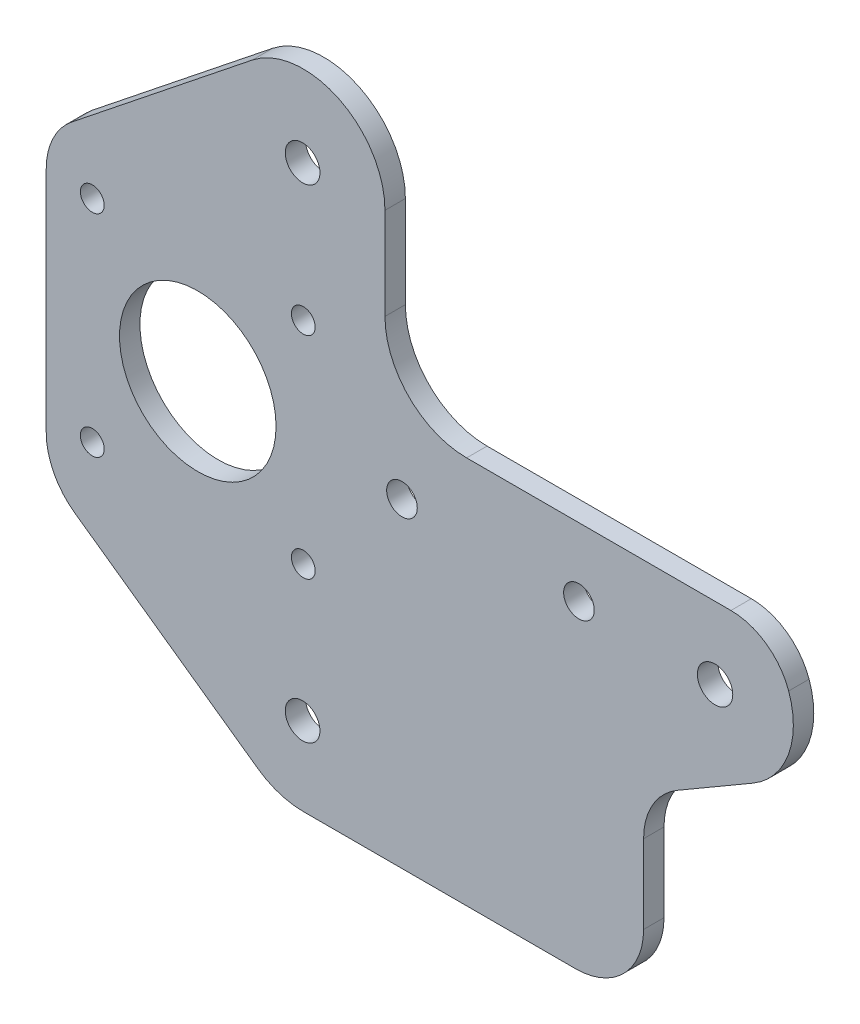
ISO-10303-21;
HEADER;
FILE_DESCRIPTION(('STEP AP214'),'2;1');
FILE_NAME('part.step','',(''),(''),'','','');
FILE_SCHEMA(('AUTOMOTIVE_DESIGN { 1 0 10303 214 1 1 1 1 }'));
ENDSEC;
DATA;
#1=APPLICATION_CONTEXT('core data for automotive mechanical design processes');
#2=APPLICATION_PROTOCOL_DEFINITION('international standard','automotive_design',2000,#1);
#3=PRODUCT_CONTEXT('',#1,'mechanical');
#4=PRODUCT('Part','Part','',(#3));
#5=PRODUCT_RELATED_PRODUCT_CATEGORY('part','',(#4));
#6=PRODUCT_DEFINITION_FORMATION('','',#4);
#7=PRODUCT_DEFINITION_CONTEXT('part definition',#1,'design');
#8=PRODUCT_DEFINITION('design','',#6,#7);
#9=PRODUCT_DEFINITION_SHAPE('','',#8);
#10=(LENGTH_UNIT() NAMED_UNIT(*) SI_UNIT(.MILLI.,.METRE.));
#11=(NAMED_UNIT(*) PLANE_ANGLE_UNIT() SI_UNIT($,.RADIAN.));
#12=(NAMED_UNIT(*) SI_UNIT($,.STERADIAN.) SOLID_ANGLE_UNIT());
#13=UNCERTAINTY_MEASURE_WITH_UNIT(LENGTH_MEASURE(1.E-05),#10,'distance_accuracy_value','');
#14=(GEOMETRIC_REPRESENTATION_CONTEXT(3) GLOBAL_UNCERTAINTY_ASSIGNED_CONTEXT((#13)) GLOBAL_UNIT_ASSIGNED_CONTEXT((#10,
#11,#12)) REPRESENTATION_CONTEXT('',''));
#15=CARTESIAN_POINT('',(0.,0.,0.));
#16=DIRECTION('',(0.,0.,1.));
#17=DIRECTION('',(1.,0.,0.));
#18=AXIS2_PLACEMENT_3D('',#15,#16,#17);
#19=CARTESIAN_POINT('',(0.,0.,0.));
#20=DIRECTION('',(0.,0.,1.));
#21=DIRECTION('',(1.,0.,0.));
#22=AXIS2_PLACEMENT_3D('',#19,#20,#21);
#23=PLANE('',#22);
#24=CARTESIAN_POINT('',(30.,0.,0.));
#25=DIRECTION('',(0.,0.,1.));
#26=DIRECTION('',(1.,0.,0.));
#27=AXIS2_PLACEMENT_3D('',#24,#25,#26);
#28=CIRCLE('',#27,2.25);
#29=CARTESIAN_POINT('',(32.25,0.,0.));
#30=VERTEX_POINT('',#29);
#31=EDGE_CURVE('E151',#30,#30,#28,.T.);
#32=ORIENTED_EDGE('',*,*,#31,.T.);
#33=EDGE_LOOP('',(#32));
#34=FACE_BOUND('',#33,.T.);
#35=CARTESIAN_POINT('',(15.4,-35.5,0.));
#36=DIRECTION('',(0.,0.,1.));
#37=DIRECTION('',(1.,0.,0.));
#38=AXIS2_PLACEMENT_3D('',#35,#36,#37);
#39=CIRCLE('',#38,2.55);
#40=CARTESIAN_POINT('',(17.95,-35.5,0.));
#41=VERTEX_POINT('',#40);
#42=EDGE_CURVE('E279',#41,#41,#39,.T.);
#43=ORIENTED_EDGE('',*,*,#42,.T.);
#44=EDGE_LOOP('',(#43));
#45=FACE_BOUND('',#44,.T.);
#46=CARTESIAN_POINT('',(15.4,35.5,0.));
#47=DIRECTION('',(0.,0.,1.));
#48=DIRECTION('',(1.,0.,0.));
#49=AXIS2_PLACEMENT_3D('',#46,#47,#48);
#50=CIRCLE('',#49,2.55);
#51=CARTESIAN_POINT('',(17.95,35.5,0.));
#52=VERTEX_POINT('',#51);
#53=EDGE_CURVE('E258',#52,#52,#50,.T.);
#54=ORIENTED_EDGE('',*,*,#53,.T.);
#55=EDGE_LOOP('',(#54));
#56=FACE_BOUND('',#55,.T.);
#57=CARTESIAN_POINT('',(-15.5,15.5,0.));
#58=DIRECTION('',(0.,0.,1.));
#59=DIRECTION('',(1.,0.,0.));
#60=AXIS2_PLACEMENT_3D('',#57,#58,#59);
#61=CIRCLE('',#60,1.75);
#62=CARTESIAN_POINT('',(-13.75,15.5,0.));
#63=VERTEX_POINT('',#62);
#64=EDGE_CURVE('E282',#63,#63,#61,.T.);
#65=ORIENTED_EDGE('',*,*,#64,.T.);
#66=EDGE_LOOP('',(#65));
#67=FACE_BOUND('',#66,.T.);
#68=CARTESIAN_POINT('',(-15.5,-15.5,0.));
#69=DIRECTION('',(0.,0.,1.));
#70=DIRECTION('',(1.,0.,0.));
#71=AXIS2_PLACEMENT_3D('',#68,#69,#70);
#72=CIRCLE('',#71,1.75);
#73=CARTESIAN_POINT('',(-13.75,-15.5,0.));
#74=VERTEX_POINT('',#73);
#75=EDGE_CURVE('E255',#74,#74,#72,.T.);
#76=ORIENTED_EDGE('',*,*,#75,.T.);
#77=EDGE_LOOP('',(#76));
#78=FACE_BOUND('',#77,.T.);
#79=CARTESIAN_POINT('',(15.5,-15.5,0.));
#80=DIRECTION('',(0.,0.,1.));
#81=DIRECTION('',(1.,0.,0.));
#82=AXIS2_PLACEMENT_3D('',#79,#80,#81);
#83=CIRCLE('',#82,1.75);
#84=CARTESIAN_POINT('',(17.25,-15.5,0.));
#85=VERTEX_POINT('',#84);
#86=EDGE_CURVE('E285',#85,#85,#83,.T.);
#87=ORIENTED_EDGE('',*,*,#86,.T.);
#88=EDGE_LOOP('',(#87));
#89=FACE_BOUND('',#88,.T.);
#90=CARTESIAN_POINT('',(15.5,15.5,0.));
#91=DIRECTION('',(0.,0.,1.));
#92=DIRECTION('',(1.,0.,0.));
#93=AXIS2_PLACEMENT_3D('',#90,#91,#92);
#94=CIRCLE('',#93,1.75);
#95=CARTESIAN_POINT('',(17.25,15.5,0.));
#96=VERTEX_POINT('',#95);
#97=EDGE_CURVE('E252',#96,#96,#94,.T.);
#98=ORIENTED_EDGE('',*,*,#97,.T.);
#99=EDGE_LOOP('',(#98));
#100=FACE_BOUND('',#99,.T.);
#101=CARTESIAN_POINT('',(0.,0.,0.));
#102=DIRECTION('',(0.,0.,1.));
#103=DIRECTION('',(1.,0.,0.));
#104=AXIS2_PLACEMENT_3D('',#101,#102,#103);
#105=CIRCLE('',#104,11.5);
#106=CARTESIAN_POINT('',(11.5,0.,0.));
#107=VERTEX_POINT('',#106);
#108=EDGE_CURVE('E287',#107,#107,#105,.T.);
#109=ORIENTED_EDGE('',*,*,#108,.T.);
#110=EDGE_LOOP('',(#109));
#111=FACE_BOUND('',#110,.T.);
#112=CARTESIAN_POINT('',(56.,0.,0.));
#113=DIRECTION('',(0.,0.,1.));
#114=DIRECTION('',(1.,0.,0.));
#115=AXIS2_PLACEMENT_3D('',#112,#113,#114);
#116=CIRCLE('',#115,2.25);
#117=CARTESIAN_POINT('',(58.25,0.,0.));
#118=VERTEX_POINT('',#117);
#119=EDGE_CURVE('E249',#118,#118,#116,.T.);
#120=ORIENTED_EDGE('',*,*,#119,.T.);
#121=EDGE_LOOP('',(#120));
#122=FACE_BOUND('',#121,.T.);
#123=CARTESIAN_POINT('',(75.5,0.,0.));
#124=DIRECTION('',(0.,0.,1.));
#125=DIRECTION('',(1.,0.,0.));
#126=AXIS2_PLACEMENT_3D('',#123,#124,#125);
#127=CIRCLE('',#126,12.);
#128=CARTESIAN_POINT('',(81.5363224728649,-10.3712492499026,0.));
#129=VERTEX_POINT('',#128);
#130=CARTESIAN_POINT('',(86.8137084989854,4.00000000000889,0.));
#131=VERTEX_POINT('',#130);
#132=EDGE_CURVE('E263',#129,#131,#127,.T.);
#133=ORIENTED_EDGE('',*,*,#132,.F.);
#134=DIRECTION('',(0.864270770825398,0.503026872738299,0.));
#135=VECTOR('',#134,1.);
#136=CARTESIAN_POINT('',(21.28480903649,-45.43911386449,0.));
#137=LINE('',#136,#135);
#138=CARTESIAN_POINT('',(70.4697312726384,-16.8122778618127,0.));
#139=VERTEX_POINT('',#138);
#140=EDGE_CURVE('E165',#139,#129,#137,.T.);
#141=ORIENTED_EDGE('',*,*,#140,.F.);
#142=CARTESIAN_POINT('',(75.5,-25.45498557008,0.));
#143=DIRECTION('',(0.,0.,1.));
#144=DIRECTION('',(1.,0.,0.));
#145=AXIS2_PLACEMENT_3D('',#142,#143,#144);
#146=CIRCLE('',#145,10.);
#147=CARTESIAN_POINT('',(65.5,-25.45498557008,0.));
#148=VERTEX_POINT('',#147);
#149=EDGE_CURVE('E173',#139,#148,#146,.T.);
#150=ORIENTED_EDGE('',*,*,#149,.T.);
#151=DIRECTION('',(0.,1.,0.));
#152=VECTOR('',#151,1.);
#153=CARTESIAN_POINT('',(65.5,-47.,0.));
#154=LINE('',#153,#152);
#155=CARTESIAN_POINT('',(65.5,-37.,0.));
#156=VERTEX_POINT('',#155);
#157=EDGE_CURVE('E170',#156,#148,#154,.T.);
#158=ORIENTED_EDGE('',*,*,#157,.F.);
#159=CARTESIAN_POINT('',(55.5,-37.,0.));
#160=DIRECTION('',(0.,0.,-1.));
#161=DIRECTION('',(-1.,0.,0.));
#162=AXIS2_PLACEMENT_3D('',#159,#160,#161);
#163=CIRCLE('',#162,10.);
#164=CARTESIAN_POINT('',(55.5,-47.,0.));
#165=VERTEX_POINT('',#164);
#166=EDGE_CURVE('E268',#165,#156,#163,.F.);
#167=ORIENTED_EDGE('',*,*,#166,.F.);
#168=DIRECTION('',(1.,0.,0.));
#169=VECTOR('',#168,1.);
#170=CARTESIAN_POINT('',(15.5,-47.,0.));
#171=LINE('',#170,#169);
#172=CARTESIAN_POINT('',(15.5,-47.,0.));
#173=VERTEX_POINT('',#172);
#174=EDGE_CURVE('E175',#173,#165,#171,.T.);
#175=ORIENTED_EDGE('',*,*,#174,.F.);
#176=CARTESIAN_POINT('',(15.5,-35.5,0.));
#177=DIRECTION('',(0.,0.,1.));
#178=DIRECTION('',(1.,0.,0.));
#179=AXIS2_PLACEMENT_3D('',#176,#177,#178);
#180=CIRCLE('',#179,11.5);
#181=CARTESIAN_POINT('',(8.8483318687912,-44.8811145964812,0.));
#182=VERTEX_POINT('',#181);
#183=EDGE_CURVE('E270',#182,#173,#180,.T.);
#184=ORIENTED_EDGE('',*,*,#183,.F.);
#185=DIRECTION('',(0.815749095346485,-0.578405924452189,0.));
#186=VECTOR('',#185,1.);
#187=CARTESIAN_POINT('',(-18.04825369201,-25.81012263995,0.));
#188=LINE('',#187,#186);
#189=CARTESIAN_POINT('',(-18.0482536919971,-25.8101226399591,0.));
#190=VERTEX_POINT('',#189);
#191=EDGE_CURVE('E179',#190,#182,#188,.T.);
#192=ORIENTED_EDGE('',*,*,#191,.F.);
#193=CARTESIAN_POINT('',(-12.26419444749,-17.65263168648,0.));
#194=DIRECTION('',(0.,0.,1.));
#195=DIRECTION('',(1.,0.,0.));
#196=AXIS2_PLACEMENT_3D('',#193,#194,#195);
#197=CIRCLE('',#196,10.);
#198=CARTESIAN_POINT('',(-22.26419444749,-17.65263168648,0.));
#199=VERTEX_POINT('',#198);
#200=EDGE_CURVE('E272',#199,#190,#197,.T.);
#201=ORIENTED_EDGE('',*,*,#200,.F.);
#202=DIRECTION('',(0.,1.,0.));
#203=VECTOR('',#202,1.);
#204=CARTESIAN_POINT('',(-22.26419444749,15.91967145146,0.));
#205=LINE('',#204,#203);
#206=CARTESIAN_POINT('',(-22.26419444749,15.91967145146,0.));
#207=VERTEX_POINT('',#206);
#208=EDGE_CURVE('E183',#207,#199,#205,.F.);
#209=ORIENTED_EDGE('',*,*,#208,.F.);
#210=CARTESIAN_POINT('',(-12.26419444749,15.91967145146,0.));
#211=DIRECTION('',(0.,0.,1.));
#212=DIRECTION('',(1.,0.,0.));
#213=AXIS2_PLACEMENT_3D('',#210,#211,#212);
#214=CIRCLE('',#213,10.);
#215=CARTESIAN_POINT('',(-18.4985911058109,23.7383860713092,0.));
#216=VERTEX_POINT('',#215);
#217=EDGE_CURVE('E274',#216,#207,#214,.T.);
#218=ORIENTED_EDGE('',*,*,#217,.F.);
#219=DIRECTION('',(-0.781871461986013,-0.62343966583131,0.));
#220=VECTOR('',#219,1.);
#221=CARTESIAN_POINT('',(8.018724010025,44.88245754383,0.));
#222=LINE('',#221,#220);
#223=CARTESIAN_POINT('',(8.01872401003507,44.882457543838,0.));
#224=VERTEX_POINT('',#223);
#225=EDGE_CURVE('E187',#224,#216,#222,.T.);
#226=ORIENTED_EDGE('',*,*,#225,.F.);
#227=CARTESIAN_POINT('',(15.5,35.5,0.));
#228=DIRECTION('',(0.,0.,1.));
#229=DIRECTION('',(1.,0.,0.));
#230=AXIS2_PLACEMENT_3D('',#227,#228,#229);
#231=CIRCLE('',#230,12.);
#232=CARTESIAN_POINT('',(27.5,35.5,0.));
#233=VERTEX_POINT('',#232);
#234=EDGE_CURVE('E139',#233,#224,#231,.T.);
#235=ORIENTED_EDGE('',*,*,#234,.F.);
#236=DIRECTION('',(0.,1.,0.));
#237=VECTOR('',#236,1.);
#238=CARTESIAN_POINT('',(27.5,35.5,0.));
#239=LINE('',#238,#237);
#240=CARTESIAN_POINT('',(27.5,22.,0.));
#241=VERTEX_POINT('',#240);
#242=EDGE_CURVE('E133',#233,#241,#239,.F.);
#243=ORIENTED_EDGE('',*,*,#242,.T.);
#244=CARTESIAN_POINT('',(39.5,22.,0.));
#245=DIRECTION('',(0.,0.,1.));
#246=DIRECTION('',(1.,0.,0.));
#247=AXIS2_PLACEMENT_3D('',#244,#245,#246);
#248=CIRCLE('',#247,12.);
#249=CARTESIAN_POINT('',(39.5,10.,0.));
#250=VERTEX_POINT('',#249);
#251=EDGE_CURVE('E136',#241,#250,#248,.T.);
#252=ORIENTED_EDGE('',*,*,#251,.T.);
#253=DIRECTION('',(1.,0.,0.));
#254=VECTOR('',#253,1.);
#255=CARTESIAN_POINT('',(39.5,10.,0.));
#256=LINE('',#255,#254);
#257=CARTESIAN_POINT('',(78.32842712475,10.,0.));
#258=VERTEX_POINT('',#257);
#259=EDGE_CURVE('E162',#250,#258,#256,.T.);
#260=ORIENTED_EDGE('',*,*,#259,.T.);
#261=CARTESIAN_POINT('',(78.32842712475,1.,0.));
#262=DIRECTION('',(0.,0.,1.));
#263=DIRECTION('',(1.,0.,0.));
#264=AXIS2_PLACEMENT_3D('',#261,#262,#263);
#265=CIRCLE('',#264,9.00000000000001);
#266=EDGE_CURVE('E261',#131,#258,#265,.T.);
#267=ORIENTED_EDGE('',*,*,#266,.F.);
#268=EDGE_LOOP('',(#133,#141,#150,#158,#167,#175,#184,#192,#201,#209,#218,#226,#235,#243,#252,
#260,#267));
#269=FACE_BOUND('',#268,.T.);
#270=CARTESIAN_POINT('',(76.,-0.574456264653834,0.));
#271=DIRECTION('',(0.,0.,1.));
#272=DIRECTION('',(1.,0.,0.));
#273=AXIS2_PLACEMENT_3D('',#270,#271,#272);
#274=CIRCLE('',#273,2.6);
#275=CARTESIAN_POINT('',(78.6,-0.574456264653834,0.));
#276=VERTEX_POINT('',#275);
#277=EDGE_CURVE('E19',#276,#276,#274,.T.);
#278=ORIENTED_EDGE('',*,*,#277,.T.);
#279=EDGE_LOOP('',(#278));
#280=FACE_BOUND('',#279,.T.);
#281=ADVANCED_FACE('F16',(#34,#45,#56,#67,#78,#89,#100,#111,#122,#269,#280),#23,.F.);
#282=CARTESIAN_POINT('',(76.,-0.574456264653834,3.));
#283=DIRECTION('',(0.,0.,1.));
#284=DIRECTION('',(1.,0.,0.));
#285=AXIS2_PLACEMENT_3D('',#282,#283,#284);
#286=CYLINDRICAL_SURFACE('',#285,2.6);
#287=CARTESIAN_POINT('',(76.,-0.574456264653834,3.));
#288=DIRECTION('',(0.,0.,1.));
#289=DIRECTION('',(1.,0.,0.));
#290=AXIS2_PLACEMENT_3D('',#287,#288,#289);
#291=CIRCLE('',#290,2.6);
#292=CARTESIAN_POINT('',(78.6,-0.574456264653834,3.));
#293=VERTEX_POINT('',#292);
#294=EDGE_CURVE('E246',#293,#293,#291,.F.);
#295=ORIENTED_EDGE('',*,*,#294,.F.);
#296=EDGE_LOOP('',(#295));
#297=FACE_BOUND('',#296,.T.);
#298=ORIENTED_EDGE('',*,*,#277,.F.);
#299=EDGE_LOOP('',(#298));
#300=FACE_BOUND('',#299,.T.);
#301=ADVANCED_FACE('F294',(#297,#300),#286,.F.);
#302=CARTESIAN_POINT('',(0.,0.,0.));
#303=DIRECTION('',(0.,0.,1.));
#304=DIRECTION('',(1.,0.,0.));
#305=AXIS2_PLACEMENT_3D('',#302,#303,#304);
#306=CYLINDRICAL_SURFACE('',#305,11.5);
#307=CARTESIAN_POINT('',(0.,0.,3.));
#308=DIRECTION('',(0.,0.,1.));
#309=DIRECTION('',(1.,0.,0.));
#310=AXIS2_PLACEMENT_3D('',#307,#308,#309);
#311=CIRCLE('',#310,11.5);
#312=CARTESIAN_POINT('',(11.5,0.,3.));
#313=VERTEX_POINT('',#312);
#314=EDGE_CURVE('E243',#313,#313,#311,.F.);
#315=ORIENTED_EDGE('',*,*,#314,.F.);
#316=EDGE_LOOP('',(#315));
#317=FACE_BOUND('',#316,.T.);
#318=ORIENTED_EDGE('',*,*,#108,.F.);
#319=EDGE_LOOP('',(#318));
#320=FACE_BOUND('',#319,.T.);
#321=ADVANCED_FACE('F296',(#317,#320),#306,.F.);
#322=CARTESIAN_POINT('',(15.5,-15.5,0.));
#323=DIRECTION('',(0.,0.,1.));
#324=DIRECTION('',(1.,0.,0.));
#325=AXIS2_PLACEMENT_3D('',#322,#323,#324);
#326=CYLINDRICAL_SURFACE('',#325,1.75);
#327=CARTESIAN_POINT('',(15.5,-15.5,3.));
#328=DIRECTION('',(0.,0.,1.));
#329=DIRECTION('',(1.,0.,0.));
#330=AXIS2_PLACEMENT_3D('',#327,#328,#329);
#331=CIRCLE('',#330,1.75);
#332=CARTESIAN_POINT('',(17.25,-15.5,3.));
#333=VERTEX_POINT('',#332);
#334=EDGE_CURVE('E240',#333,#333,#331,.F.);
#335=ORIENTED_EDGE('',*,*,#334,.F.);
#336=EDGE_LOOP('',(#335));
#337=FACE_BOUND('',#336,.T.);
#338=ORIENTED_EDGE('',*,*,#86,.F.);
#339=EDGE_LOOP('',(#338));
#340=FACE_BOUND('',#339,.T.);
#341=ADVANCED_FACE('F303',(#337,#340),#326,.F.);
#342=CARTESIAN_POINT('',(-15.5,15.5,0.));
#343=DIRECTION('',(0.,0.,1.));
#344=DIRECTION('',(1.,0.,0.));
#345=AXIS2_PLACEMENT_3D('',#342,#343,#344);
#346=CYLINDRICAL_SURFACE('',#345,1.75);
#347=CARTESIAN_POINT('',(-15.5,15.5,3.));
#348=DIRECTION('',(0.,0.,1.));
#349=DIRECTION('',(1.,0.,0.));
#350=AXIS2_PLACEMENT_3D('',#347,#348,#349);
#351=CIRCLE('',#350,1.75);
#352=CARTESIAN_POINT('',(-13.75,15.5,3.));
#353=VERTEX_POINT('',#352);
#354=EDGE_CURVE('E237',#353,#353,#351,.F.);
#355=ORIENTED_EDGE('',*,*,#354,.F.);
#356=EDGE_LOOP('',(#355));
#357=FACE_BOUND('',#356,.T.);
#358=ORIENTED_EDGE('',*,*,#64,.F.);
#359=EDGE_LOOP('',(#358));
#360=FACE_BOUND('',#359,.T.);
#361=ADVANCED_FACE('F402',(#357,#360),#346,.F.);
#362=CARTESIAN_POINT('',(15.4,-35.5,0.));
#363=DIRECTION('',(0.,0.,1.));
#364=DIRECTION('',(1.,0.,0.));
#365=AXIS2_PLACEMENT_3D('',#362,#363,#364);
#366=CYLINDRICAL_SURFACE('',#365,2.55);
#367=CARTESIAN_POINT('',(15.4,-35.5,3.));
#368=DIRECTION('',(0.,0.,1.));
#369=DIRECTION('',(1.,0.,0.));
#370=AXIS2_PLACEMENT_3D('',#367,#368,#369);
#371=CIRCLE('',#370,2.55);
#372=CARTESIAN_POINT('',(17.95,-35.5,3.));
#373=VERTEX_POINT('',#372);
#374=EDGE_CURVE('E234',#373,#373,#371,.F.);
#375=ORIENTED_EDGE('',*,*,#374,.F.);
#376=EDGE_LOOP('',(#375));
#377=FACE_BOUND('',#376,.T.);
#378=ORIENTED_EDGE('',*,*,#42,.F.);
#379=EDGE_LOOP('',(#378));
#380=FACE_BOUND('',#379,.T.);
#381=ADVANCED_FACE('F398',(#377,#380),#366,.F.);
#382=CARTESIAN_POINT('',(30.,0.,3.));
#383=DIRECTION('',(0.,0.,1.));
#384=DIRECTION('',(1.,0.,0.));
#385=AXIS2_PLACEMENT_3D('',#382,#383,#384);
#386=CYLINDRICAL_SURFACE('',#385,2.25);
#387=CARTESIAN_POINT('',(30.,0.,3.));
#388=DIRECTION('',(0.,0.,1.));
#389=DIRECTION('',(1.,0.,0.));
#390=AXIS2_PLACEMENT_3D('',#387,#388,#389);
#391=CIRCLE('',#390,2.25);
#392=CARTESIAN_POINT('',(32.25,0.,3.));
#393=VERTEX_POINT('',#392);
#394=EDGE_CURVE('E231',#393,#393,#391,.F.);
#395=ORIENTED_EDGE('',*,*,#394,.F.);
#396=EDGE_LOOP('',(#395));
#397=FACE_BOUND('',#396,.T.);
#398=ORIENTED_EDGE('',*,*,#31,.F.);
#399=EDGE_LOOP('',(#398));
#400=FACE_BOUND('',#399,.T.);
#401=ADVANCED_FACE('F395',(#397,#400),#386,.F.);
#402=CARTESIAN_POINT('',(39.5,22.,3.));
#403=DIRECTION('',(0.,0.,1.));
#404=DIRECTION('',(1.,0.,0.));
#405=AXIS2_PLACEMENT_3D('',#402,#403,#404);
#406=CYLINDRICAL_SURFACE('',#405,12.);
#407=CARTESIAN_POINT('',(39.5,22.,3.));
#408=DIRECTION('',(0.,0.,1.));
#409=DIRECTION('',(1.,0.,0.));
#410=AXIS2_PLACEMENT_3D('',#407,#408,#409);
#411=CIRCLE('',#410,12.);
#412=CARTESIAN_POINT('',(39.5,9.99999999999987,3.));
#413=VERTEX_POINT('',#412);
#414=CARTESIAN_POINT('',(27.5,22.,3.));
#415=VERTEX_POINT('',#414);
#416=EDGE_CURVE('E229',#413,#415,#411,.F.);
#417=ORIENTED_EDGE('',*,*,#416,.F.);
#418=DIRECTION('',(0.,0.,-1.));
#419=VECTOR('',#418,1.);
#420=CARTESIAN_POINT('',(39.5,10.,3.));
#421=LINE('',#420,#419);
#422=EDGE_CURVE('E149',#413,#250,#421,.T.);
#423=ORIENTED_EDGE('',*,*,#422,.T.);
#424=ORIENTED_EDGE('',*,*,#251,.F.);
#425=DIRECTION('',(0.,0.,1.));
#426=VECTOR('',#425,1.);
#427=CARTESIAN_POINT('',(27.5,22.,3.));
#428=LINE('',#427,#426);
#429=EDGE_CURVE('E143',#241,#415,#428,.T.);
#430=ORIENTED_EDGE('',*,*,#429,.T.);
#431=EDGE_LOOP('',(#417,#423,#424,#430));
#432=FACE_BOUND('',#431,.T.);
#433=ADVANCED_FACE('F146',(#432),#406,.F.);
#434=CARTESIAN_POINT('',(27.5,35.5,3.));
#435=DIRECTION('',(-1.,0.,0.));
#436=DIRECTION('',(0.,0.,1.));
#437=AXIS2_PLACEMENT_3D('',#434,#435,#436);
#438=PLANE('',#437);
#439=DIRECTION('',(0.,1.,0.));
#440=VECTOR('',#439,1.);
#441=CARTESIAN_POINT('',(27.5,22.,3.));
#442=LINE('',#441,#440);
#443=CARTESIAN_POINT('',(27.5,35.5,3.));
#444=VERTEX_POINT('',#443);
#445=EDGE_CURVE('E155',#415,#444,#442,.T.);
#446=ORIENTED_EDGE('',*,*,#445,.F.);
#447=ORIENTED_EDGE('',*,*,#429,.F.);
#448=ORIENTED_EDGE('',*,*,#242,.F.);
#449=DIRECTION('',(0.,0.,1.));
#450=VECTOR('',#449,1.);
#451=CARTESIAN_POINT('',(27.5,35.5,0.));
#452=LINE('',#451,#450);
#453=EDGE_CURVE('E157',#444,#233,#452,.F.);
#454=ORIENTED_EDGE('',*,*,#453,.F.);
#455=EDGE_LOOP('',(#446,#447,#448,#454));
#456=FACE_BOUND('',#455,.T.);
#457=ADVANCED_FACE('F153',(#456),#438,.F.);
#458=CARTESIAN_POINT('',(15.5,35.5,0.));
#459=DIRECTION('',(0.,0.,1.));
#460=DIRECTION('',(1.,0.,0.));
#461=AXIS2_PLACEMENT_3D('',#458,#459,#460);
#462=CYLINDRICAL_SURFACE('',#461,12.);
#463=ORIENTED_EDGE('',*,*,#453,.T.);
#464=ORIENTED_EDGE('',*,*,#234,.T.);
#465=DIRECTION('',(0.,0.,1.));
#466=VECTOR('',#465,1.);
#467=CARTESIAN_POINT('',(8.01872401004453,44.8824575438456,0.));
#468=LINE('',#467,#466);
#469=CARTESIAN_POINT('',(8.01872401003358,44.8824575438399,3.));
#470=VERTEX_POINT('',#469);
#471=EDGE_CURVE('E189',#470,#224,#468,.F.);
#472=ORIENTED_EDGE('',*,*,#471,.F.);
#473=CARTESIAN_POINT('',(15.5,35.5,3.));
#474=DIRECTION('',(0.,0.,1.));
#475=DIRECTION('',(1.,0.,0.));
#476=AXIS2_PLACEMENT_3D('',#473,#474,#475);
#477=CIRCLE('',#476,12.);
#478=EDGE_CURVE('E226',#444,#470,#477,.T.);
#479=ORIENTED_EDGE('',*,*,#478,.F.);
#480=EDGE_LOOP('',(#463,#464,#472,#479));
#481=FACE_BOUND('',#480,.T.);
#482=ADVANCED_FACE('F386',(#481),#462,.T.);
#483=CARTESIAN_POINT('',(8.018724010025,44.88245754383,0.));
#484=DIRECTION('',(-0.62343966583131,0.781871461986013,0.));
#485=DIRECTION('',(-0.781871461986013,-0.62343966583131,0.));
#486=AXIS2_PLACEMENT_3D('',#483,#484,#485);
#487=PLANE('',#486);
#488=ORIENTED_EDGE('',*,*,#471,.T.);
#489=ORIENTED_EDGE('',*,*,#225,.T.);
#490=DIRECTION('',(0.,0.,1.));
#491=VECTOR('',#490,1.);
#492=CARTESIAN_POINT('',(-18.4985911058232,23.7383860713041,0.));
#493=LINE('',#492,#491);
#494=CARTESIAN_POINT('',(-18.4985911058124,23.7383860713111,3.));
#495=VERTEX_POINT('',#494);
#496=EDGE_CURVE('E188',#495,#216,#493,.F.);
#497=ORIENTED_EDGE('',*,*,#496,.F.);
#498=DIRECTION('',(-0.781871461986012,-0.62343966583131,0.));
#499=VECTOR('',#498,1.);
#500=CARTESIAN_POINT('',(8.01872401004155,44.8824575438493,3.));
#501=LINE('',#500,#499);
#502=EDGE_CURVE('E225',#470,#495,#501,.T.);
#503=ORIENTED_EDGE('',*,*,#502,.F.);
#504=EDGE_LOOP('',(#488,#489,#497,#503));
#505=FACE_BOUND('',#504,.T.);
#506=ADVANCED_FACE('F382',(#505),#487,.T.);
#507=CARTESIAN_POINT('',(-12.26419444749,15.91967145146,0.));
#508=DIRECTION('',(0.,0.,1.));
#509=DIRECTION('',(1.,0.,0.));
#510=AXIS2_PLACEMENT_3D('',#507,#508,#509);
#511=CYLINDRICAL_SURFACE('',#510,10.);
#512=ORIENTED_EDGE('',*,*,#496,.T.);
#513=ORIENTED_EDGE('',*,*,#217,.T.);
#514=DIRECTION('',(0.,0.,1.));
#515=VECTOR('',#514,1.);
#516=CARTESIAN_POINT('',(-22.26419444749,15.91967145146,0.));
#517=LINE('',#516,#515);
#518=CARTESIAN_POINT('',(-22.2641944474894,15.91967145146,3.));
#519=VERTEX_POINT('',#518);
#520=EDGE_CURVE('E186',#519,#207,#517,.F.);
#521=ORIENTED_EDGE('',*,*,#520,.F.);
#522=CARTESIAN_POINT('',(-12.26419444749,15.91967145146,3.));
#523=DIRECTION('',(0.,0.,1.));
#524=DIRECTION('',(1.,0.,0.));
#525=AXIS2_PLACEMENT_3D('',#522,#523,#524);
#526=CIRCLE('',#525,10.);
#527=EDGE_CURVE('E222',#495,#519,#526,.T.);
#528=ORIENTED_EDGE('',*,*,#527,.F.);
#529=EDGE_LOOP('',(#512,#513,#521,#528));
#530=FACE_BOUND('',#529,.T.);
#531=ADVANCED_FACE('F378',(#530),#511,.T.);
#532=CARTESIAN_POINT('',(-22.26419444749,15.91967145146,0.));
#533=DIRECTION('',(-1.,0.,0.));
#534=DIRECTION('',(0.,0.,1.));
#535=AXIS2_PLACEMENT_3D('',#532,#533,#534);
#536=PLANE('',#535);
#537=ORIENTED_EDGE('',*,*,#520,.T.);
#538=ORIENTED_EDGE('',*,*,#208,.T.);
#539=DIRECTION('',(0.,0.,1.));
#540=VECTOR('',#539,1.);
#541=CARTESIAN_POINT('',(-22.26419444749,-17.65263168648,0.));
#542=LINE('',#541,#540);
#543=CARTESIAN_POINT('',(-22.2641944474894,-17.65263168648,3.));
#544=VERTEX_POINT('',#543);
#545=EDGE_CURVE('E185',#544,#199,#542,.F.);
#546=ORIENTED_EDGE('',*,*,#545,.F.);
#547=DIRECTION('',(0.,1.,0.));
#548=VECTOR('',#547,1.);
#549=CARTESIAN_POINT('',(-22.2641944474887,22.,3.));
#550=LINE('',#549,#548);
#551=EDGE_CURVE('E221',#519,#544,#550,.F.);
#552=ORIENTED_EDGE('',*,*,#551,.F.);
#553=EDGE_LOOP('',(#537,#538,#546,#552));
#554=FACE_BOUND('',#553,.T.);
#555=ADVANCED_FACE('F374',(#554),#536,.T.);
#556=CARTESIAN_POINT('',(-12.26419444749,-17.65263168648,0.));
#557=DIRECTION('',(0.,0.,1.));
#558=DIRECTION('',(1.,0.,0.));
#559=AXIS2_PLACEMENT_3D('',#556,#557,#558);
#560=CYLINDRICAL_SURFACE('',#559,10.);
#561=ORIENTED_EDGE('',*,*,#545,.T.);
#562=ORIENTED_EDGE('',*,*,#200,.T.);
#563=DIRECTION('',(0.,0.,1.));
#564=VECTOR('',#563,1.);
#565=CARTESIAN_POINT('',(-18.0482536919806,-25.8101226399708,0.));
#566=LINE('',#565,#564);
#567=CARTESIAN_POINT('',(-18.0482536919968,-25.8101226399584,3.));
#568=VERTEX_POINT('',#567);
#569=EDGE_CURVE('E182',#568,#190,#566,.F.);
#570=ORIENTED_EDGE('',*,*,#569,.F.);
#571=CARTESIAN_POINT('',(-12.26419444749,-17.65263168648,3.));
#572=DIRECTION('',(0.,0.,1.));
#573=DIRECTION('',(1.,0.,0.));
#574=AXIS2_PLACEMENT_3D('',#571,#572,#573);
#575=CIRCLE('',#574,10.);
#576=EDGE_CURVE('E218',#544,#568,#575,.T.);
#577=ORIENTED_EDGE('',*,*,#576,.F.);
#578=EDGE_LOOP('',(#561,#562,#570,#577));
#579=FACE_BOUND('',#578,.T.);
#580=ADVANCED_FACE('F370',(#579),#560,.T.);
#581=CARTESIAN_POINT('',(-18.04825369201,-25.81012263995,0.));
#582=DIRECTION('',(-0.578405924452189,-0.815749095346485,0.));
#583=DIRECTION('',(0.815749095346485,-0.578405924452189,0.));
#584=AXIS2_PLACEMENT_3D('',#581,#582,#583);
#585=PLANE('',#584);
#586=ORIENTED_EDGE('',*,*,#569,.T.);
#587=ORIENTED_EDGE('',*,*,#191,.T.);
#588=DIRECTION('',(0.,0.,1.));
#589=VECTOR('',#588,1.);
#590=CARTESIAN_POINT('',(8.84833186878513,-44.8811145964742,0.));
#591=LINE('',#590,#589);
#592=CARTESIAN_POINT('',(8.84833186879134,-44.8811145964808,3.));
#593=VERTEX_POINT('',#592);
#594=EDGE_CURVE('E181',#593,#182,#591,.F.);
#595=ORIENTED_EDGE('',*,*,#594,.F.);
#596=DIRECTION('',(0.815749095346473,-0.578405924452207,0.));
#597=VECTOR('',#596,1.);
#598=CARTESIAN_POINT('',(-18.0482536919797,-25.8101226399696,3.));
#599=LINE('',#598,#597);
#600=EDGE_CURVE('E217',#568,#593,#599,.T.);
#601=ORIENTED_EDGE('',*,*,#600,.F.);
#602=EDGE_LOOP('',(#586,#587,#595,#601));
#603=FACE_BOUND('',#602,.T.);
#604=ADVANCED_FACE('F366',(#603),#585,.T.);
#605=CARTESIAN_POINT('',(15.5,-35.5,0.));
#606=DIRECTION('',(0.,0.,1.));
#607=DIRECTION('',(1.,0.,0.));
#608=AXIS2_PLACEMENT_3D('',#605,#606,#607);
#609=CYLINDRICAL_SURFACE('',#608,11.5);
#610=DIRECTION('',(0.,0.,-1.));
#611=VECTOR('',#610,1.);
#612=CARTESIAN_POINT('',(15.5,-47.,3.));
#613=LINE('',#612,#611);
#614=CARTESIAN_POINT('',(15.5,-47.0000000000009,3.));
#615=VERTEX_POINT('',#614);
#616=EDGE_CURVE('E178',#615,#173,#613,.T.);
#617=ORIENTED_EDGE('',*,*,#616,.F.);
#618=CARTESIAN_POINT('',(15.5,-35.5,3.));
#619=DIRECTION('',(0.,0.,1.));
#620=DIRECTION('',(1.,0.,0.));
#621=AXIS2_PLACEMENT_3D('',#618,#619,#620);
#622=CIRCLE('',#621,11.5);
#623=EDGE_CURVE('E214',#593,#615,#622,.T.);
#624=ORIENTED_EDGE('',*,*,#623,.F.);
#625=ORIENTED_EDGE('',*,*,#594,.T.);
#626=ORIENTED_EDGE('',*,*,#183,.T.);
#627=EDGE_LOOP('',(#617,#624,#625,#626));
#628=FACE_BOUND('',#627,.T.);
#629=ADVANCED_FACE('F362',(#628),#609,.T.);
#630=CARTESIAN_POINT('',(15.5,-47.,3.));
#631=DIRECTION('',(0.,-1.,0.));
#632=DIRECTION('',(0.,0.,-1.));
#633=AXIS2_PLACEMENT_3D('',#630,#631,#632);
#634=PLANE('',#633);
#635=DIRECTION('',(0.,0.,-1.));
#636=VECTOR('',#635,1.);
#637=CARTESIAN_POINT('',(55.5,-47.,15.3276));
#638=LINE('',#637,#636);
#639=CARTESIAN_POINT('',(55.5,-47.0000000000009,3.));
#640=VERTEX_POINT('',#639);
#641=EDGE_CURVE('E177',#640,#165,#638,.T.);
#642=ORIENTED_EDGE('',*,*,#641,.F.);
#643=DIRECTION('',(1.,0.,0.));
#644=VECTOR('',#643,1.);
#645=CARTESIAN_POINT('',(39.5,-47.0000000000018,3.));
#646=LINE('',#645,#644);
#647=EDGE_CURVE('E213',#615,#640,#646,.T.);
#648=ORIENTED_EDGE('',*,*,#647,.F.);
#649=ORIENTED_EDGE('',*,*,#616,.T.);
#650=ORIENTED_EDGE('',*,*,#174,.T.);
#651=EDGE_LOOP('',(#642,#648,#649,#650));
#652=FACE_BOUND('',#651,.T.);
#653=ADVANCED_FACE('F358',(#652),#634,.T.);
#654=CARTESIAN_POINT('',(55.5,-37.,15.3276));
#655=DIRECTION('',(0.,0.,-1.));
#656=DIRECTION('',(-1.,0.,0.));
#657=AXIS2_PLACEMENT_3D('',#654,#655,#656);
#658=CYLINDRICAL_SURFACE('',#657,10.);
#659=ORIENTED_EDGE('',*,*,#641,.T.);
#660=ORIENTED_EDGE('',*,*,#166,.T.);
#661=DIRECTION('',(0.,0.,-1.));
#662=VECTOR('',#661,1.);
#663=CARTESIAN_POINT('',(65.5,-37.,3.));
#664=LINE('',#663,#662);
#665=CARTESIAN_POINT('',(65.5,-37.,3.));
#666=VERTEX_POINT('',#665);
#667=EDGE_CURVE('E174',#666,#156,#664,.T.);
#668=ORIENTED_EDGE('',*,*,#667,.F.);
#669=CARTESIAN_POINT('',(55.5,-37.,3.));
#670=DIRECTION('',(0.,0.,-1.));
#671=DIRECTION('',(-1.,0.,0.));
#672=AXIS2_PLACEMENT_3D('',#669,#670,#671);
#673=CIRCLE('',#672,10.);
#674=EDGE_CURVE('E210',#640,#666,#673,.F.);
#675=ORIENTED_EDGE('',*,*,#674,.F.);
#676=EDGE_LOOP('',(#659,#660,#668,#675));
#677=FACE_BOUND('',#676,.T.);
#678=ADVANCED_FACE('F354',(#677),#658,.T.);
#679=CARTESIAN_POINT('',(65.5,-47.,3.));
#680=DIRECTION('',(1.,0.,0.));
#681=DIRECTION('',(0.,0.,-1.));
#682=AXIS2_PLACEMENT_3D('',#679,#680,#681);
#683=PLANE('',#682);
#684=ORIENTED_EDGE('',*,*,#667,.T.);
#685=ORIENTED_EDGE('',*,*,#157,.T.);
#686=DIRECTION('',(0.,0.,1.));
#687=VECTOR('',#686,1.);
#688=CARTESIAN_POINT('',(65.5,-25.45498557008,-12.3276));
#689=LINE('',#688,#687);
#690=CARTESIAN_POINT('',(65.5,-25.45498557008,3.));
#691=VERTEX_POINT('',#690);
#692=EDGE_CURVE('E267',#148,#691,#689,.T.);
#693=ORIENTED_EDGE('',*,*,#692,.T.);
#694=DIRECTION('',(0.,1.,0.));
#695=VECTOR('',#694,1.);
#696=CARTESIAN_POINT('',(65.5,22.,3.));
#697=LINE('',#696,#695);
#698=EDGE_CURVE('E209',#666,#691,#697,.T.);
#699=ORIENTED_EDGE('',*,*,#698,.F.);
#700=EDGE_LOOP('',(#684,#685,#693,#699));
#701=FACE_BOUND('',#700,.T.);
#702=ADVANCED_FACE('F350',(#701),#683,.T.);
#703=CARTESIAN_POINT('',(75.5,-25.45498557008,-12.3276));
#704=DIRECTION('',(0.,0.,1.));
#705=DIRECTION('',(1.,0.,0.));
#706=AXIS2_PLACEMENT_3D('',#703,#704,#705);
#707=CYLINDRICAL_SURFACE('',#706,10.);
#708=ORIENTED_EDGE('',*,*,#149,.F.);
#709=DIRECTION('',(0.,0.,1.));
#710=VECTOR('',#709,1.);
#711=CARTESIAN_POINT('',(70.4697312726601,-16.8122778618001,0.));
#712=LINE('',#711,#710);
#713=CARTESIAN_POINT('',(70.469731272638,-16.812277861813,3.));
#714=VERTEX_POINT('',#713);
#715=EDGE_CURVE('E169',#714,#139,#712,.F.);
#716=ORIENTED_EDGE('',*,*,#715,.F.);
#717=CARTESIAN_POINT('',(75.5,-25.45498557008,3.));
#718=DIRECTION('',(0.,0.,1.));
#719=DIRECTION('',(1.,0.,0.));
#720=AXIS2_PLACEMENT_3D('',#717,#718,#719);
#721=CIRCLE('',#720,10.);
#722=EDGE_CURVE('E206',#691,#714,#721,.F.);
#723=ORIENTED_EDGE('',*,*,#722,.F.);
#724=ORIENTED_EDGE('',*,*,#692,.F.);
#725=EDGE_LOOP('',(#708,#716,#723,#724));
#726=FACE_BOUND('',#725,.T.);
#727=ADVANCED_FACE('F346',(#726),#707,.F.);
#728=CARTESIAN_POINT('',(21.28480903649,-45.43911386449,0.));
#729=DIRECTION('',(0.503026872738299,-0.864270770825398,0.));
#730=DIRECTION('',(0.864270770825398,0.503026872738299,0.));
#731=AXIS2_PLACEMENT_3D('',#728,#729,#730);
#732=PLANE('',#731);
#733=ORIENTED_EDGE('',*,*,#715,.T.);
#734=ORIENTED_EDGE('',*,*,#140,.T.);
#735=DIRECTION('',(0.,0.,1.));
#736=VECTOR('',#735,1.);
#737=CARTESIAN_POINT('',(81.5363224728694,-10.371249249899,0.));
#738=LINE('',#737,#736);
#739=CARTESIAN_POINT('',(81.5363224728651,-10.3712492499019,3.));
#740=VERTEX_POINT('',#739);
#741=EDGE_CURVE('E168',#740,#129,#738,.F.);
#742=ORIENTED_EDGE('',*,*,#741,.F.);
#743=DIRECTION('',(0.86427077082535,0.503026872738381,0.));
#744=VECTOR('',#743,1.);
#745=CARTESIAN_POINT('',(70.4697312726601,-16.8122778618002,3.));
#746=LINE('',#745,#744);
#747=EDGE_CURVE('E205',#714,#740,#746,.T.);
#748=ORIENTED_EDGE('',*,*,#747,.F.);
#749=EDGE_LOOP('',(#733,#734,#742,#748));
#750=FACE_BOUND('',#749,.T.);
#751=ADVANCED_FACE('F342',(#750),#732,.T.);
#752=CARTESIAN_POINT('',(75.5,0.,0.));
#753=DIRECTION('',(0.,0.,1.));
#754=DIRECTION('',(1.,0.,0.));
#755=AXIS2_PLACEMENT_3D('',#752,#753,#754);
#756=CYLINDRICAL_SURFACE('',#755,12.);
#757=DIRECTION('',(0.,0.,1.));
#758=VECTOR('',#757,1.);
#759=CARTESIAN_POINT('',(86.813708498981,4.00000000002136,-11.1252));
#760=LINE('',#759,#758);
#761=CARTESIAN_POINT('',(86.8137084989854,4.00000000000889,3.));
#762=VERTEX_POINT('',#761);
#763=EDGE_CURVE('E164',#762,#131,#760,.F.);
#764=ORIENTED_EDGE('',*,*,#763,.F.);
#765=CARTESIAN_POINT('',(75.5,0.,3.));
#766=DIRECTION('',(0.,0.,1.));
#767=DIRECTION('',(1.,0.,0.));
#768=AXIS2_PLACEMENT_3D('',#765,#766,#767);
#769=CIRCLE('',#768,12.);
#770=EDGE_CURVE('E203',#740,#762,#769,.T.);
#771=ORIENTED_EDGE('',*,*,#770,.F.);
#772=ORIENTED_EDGE('',*,*,#741,.T.);
#773=ORIENTED_EDGE('',*,*,#132,.T.);
#774=EDGE_LOOP('',(#764,#771,#772,#773));
#775=FACE_BOUND('',#774,.T.);
#776=ADVANCED_FACE('F339',(#775),#756,.T.);
#777=CARTESIAN_POINT('',(78.32842712475,1.,-11.1252));
#778=DIRECTION('',(0.,0.,1.));
#779=DIRECTION('',(1.,0.,0.));
#780=AXIS2_PLACEMENT_3D('',#777,#778,#779);
#781=CYLINDRICAL_SURFACE('',#780,9.00000000000001);
#782=CARTESIAN_POINT('',(78.32842712475,1.,3.));
#783=DIRECTION('',(0.,0.,1.));
#784=DIRECTION('',(1.,0.,0.));
#785=AXIS2_PLACEMENT_3D('',#782,#783,#784);
#786=CIRCLE('',#785,9.00000000000001);
#787=CARTESIAN_POINT('',(78.32842712475,9.99999999999987,3.));
#788=VERTEX_POINT('',#787);
#789=EDGE_CURVE('E200',#762,#788,#786,.T.);
#790=ORIENTED_EDGE('',*,*,#789,.F.);
#791=ORIENTED_EDGE('',*,*,#763,.T.);
#792=ORIENTED_EDGE('',*,*,#266,.T.);
#793=DIRECTION('',(0.,0.,-1.));
#794=VECTOR('',#793,1.);
#795=CARTESIAN_POINT('',(78.32842712475,10.,3.));
#796=LINE('',#795,#794);
#797=EDGE_CURVE('E34',#258,#788,#796,.F.);
#798=ORIENTED_EDGE('',*,*,#797,.T.);
#799=EDGE_LOOP('',(#790,#791,#792,#798));
#800=FACE_BOUND('',#799,.T.);
#801=ADVANCED_FACE('F335',(#800),#781,.T.);
#802=CARTESIAN_POINT('',(39.5,10.,3.));
#803=DIRECTION('',(0.,-1.,0.));
#804=DIRECTION('',(0.,0.,-1.));
#805=AXIS2_PLACEMENT_3D('',#802,#803,#804);
#806=PLANE('',#805);
#807=DIRECTION('',(1.,0.,0.));
#808=VECTOR('',#807,1.);
#809=CARTESIAN_POINT('',(39.5,9.99999999999974,3.));
#810=LINE('',#809,#808);
#811=EDGE_CURVE('E199',#788,#413,#810,.F.);
#812=ORIENTED_EDGE('',*,*,#811,.F.);
#813=ORIENTED_EDGE('',*,*,#797,.F.);
#814=ORIENTED_EDGE('',*,*,#259,.F.);
#815=ORIENTED_EDGE('',*,*,#422,.F.);
#816=EDGE_LOOP('',(#812,#813,#814,#815));
#817=FACE_BOUND('',#816,.T.);
#818=ADVANCED_FACE('F331',(#817),#806,.F.);
#819=CARTESIAN_POINT('',(15.4,35.5,0.));
#820=DIRECTION('',(0.,0.,1.));
#821=DIRECTION('',(1.,0.,0.));
#822=AXIS2_PLACEMENT_3D('',#819,#820,#821);
#823=CYLINDRICAL_SURFACE('',#822,2.55);
#824=CARTESIAN_POINT('',(15.4,35.5,3.));
#825=DIRECTION('',(0.,0.,1.));
#826=DIRECTION('',(1.,0.,0.));
#827=AXIS2_PLACEMENT_3D('',#824,#825,#826);
#828=CIRCLE('',#827,2.55);
#829=CARTESIAN_POINT('',(17.95,35.5,3.));
#830=VERTEX_POINT('',#829);
#831=EDGE_CURVE('E196',#830,#830,#828,.F.);
#832=ORIENTED_EDGE('',*,*,#831,.F.);
#833=EDGE_LOOP('',(#832));
#834=FACE_BOUND('',#833,.T.);
#835=ORIENTED_EDGE('',*,*,#53,.F.);
#836=EDGE_LOOP('',(#835));
#837=FACE_BOUND('',#836,.T.);
#838=ADVANCED_FACE('F327',(#834,#837),#823,.F.);
#839=CARTESIAN_POINT('',(-15.5,-15.5,0.));
#840=DIRECTION('',(0.,0.,1.));
#841=DIRECTION('',(1.,0.,0.));
#842=AXIS2_PLACEMENT_3D('',#839,#840,#841);
#843=CYLINDRICAL_SURFACE('',#842,1.75);
#844=CARTESIAN_POINT('',(-15.5,-15.5,3.));
#845=DIRECTION('',(0.,0.,1.));
#846=DIRECTION('',(1.,0.,0.));
#847=AXIS2_PLACEMENT_3D('',#844,#845,#846);
#848=CIRCLE('',#847,1.75);
#849=CARTESIAN_POINT('',(-13.75,-15.5,3.));
#850=VERTEX_POINT('',#849);
#851=EDGE_CURVE('E193',#850,#850,#848,.F.);
#852=ORIENTED_EDGE('',*,*,#851,.F.);
#853=EDGE_LOOP('',(#852));
#854=FACE_BOUND('',#853,.T.);
#855=ORIENTED_EDGE('',*,*,#75,.F.);
#856=EDGE_LOOP('',(#855));
#857=FACE_BOUND('',#856,.T.);
#858=ADVANCED_FACE('F323',(#854,#857),#843,.F.);
#859=CARTESIAN_POINT('',(15.5,15.5,0.));
#860=DIRECTION('',(0.,0.,1.));
#861=DIRECTION('',(1.,0.,0.));
#862=AXIS2_PLACEMENT_3D('',#859,#860,#861);
#863=CYLINDRICAL_SURFACE('',#862,1.75);
#864=CARTESIAN_POINT('',(15.5,15.5,3.));
#865=DIRECTION('',(0.,0.,1.));
#866=DIRECTION('',(1.,0.,0.));
#867=AXIS2_PLACEMENT_3D('',#864,#865,#866);
#868=CIRCLE('',#867,1.75);
#869=CARTESIAN_POINT('',(17.25,15.5,3.));
#870=VERTEX_POINT('',#869);
#871=EDGE_CURVE('E25',#870,#870,#868,.F.);
#872=ORIENTED_EDGE('',*,*,#871,.F.);
#873=EDGE_LOOP('',(#872));
#874=FACE_BOUND('',#873,.T.);
#875=ORIENTED_EDGE('',*,*,#97,.F.);
#876=EDGE_LOOP('',(#875));
#877=FACE_BOUND('',#876,.T.);
#878=ADVANCED_FACE('F316',(#874,#877),#863,.F.);
#879=CARTESIAN_POINT('',(56.,0.,3.));
#880=DIRECTION('',(0.,0.,1.));
#881=DIRECTION('',(1.,0.,0.));
#882=AXIS2_PLACEMENT_3D('',#879,#880,#881);
#883=CYLINDRICAL_SURFACE('',#882,2.25);
#884=CARTESIAN_POINT('',(56.,0.,3.));
#885=DIRECTION('',(0.,0.,1.));
#886=DIRECTION('',(1.,0.,0.));
#887=AXIS2_PLACEMENT_3D('',#884,#885,#886);
#888=CIRCLE('',#887,2.25);
#889=CARTESIAN_POINT('',(58.25,0.,3.));
#890=VERTEX_POINT('',#889);
#891=EDGE_CURVE('E11',#890,#890,#888,.F.);
#892=ORIENTED_EDGE('',*,*,#891,.F.);
#893=EDGE_LOOP('',(#892));
#894=FACE_BOUND('',#893,.T.);
#895=ORIENTED_EDGE('',*,*,#119,.F.);
#896=EDGE_LOOP('',(#895));
#897=FACE_BOUND('',#896,.T.);
#898=ADVANCED_FACE('F310',(#894,#897),#883,.F.);
#899=CARTESIAN_POINT('',(39.5,22.,3.));
#900=DIRECTION('',(0.,0.,1.));
#901=DIRECTION('',(1.,0.,0.));
#902=AXIS2_PLACEMENT_3D('',#899,#900,#901);
#903=PLANE('',#902);
#904=ORIENTED_EDGE('',*,*,#891,.T.);
#905=EDGE_LOOP('',(#904));
#906=FACE_BOUND('',#905,.T.);
#907=ORIENTED_EDGE('',*,*,#871,.T.);
#908=EDGE_LOOP('',(#907));
#909=FACE_BOUND('',#908,.T.);
#910=ORIENTED_EDGE('',*,*,#851,.T.);
#911=EDGE_LOOP('',(#910));
#912=FACE_BOUND('',#911,.T.);
#913=ORIENTED_EDGE('',*,*,#831,.T.);
#914=EDGE_LOOP('',(#913));
#915=FACE_BOUND('',#914,.T.);
#916=ORIENTED_EDGE('',*,*,#789,.T.);
#917=ORIENTED_EDGE('',*,*,#811,.T.);
#918=ORIENTED_EDGE('',*,*,#416,.T.);
#919=ORIENTED_EDGE('',*,*,#445,.T.);
#920=ORIENTED_EDGE('',*,*,#478,.T.);
#921=ORIENTED_EDGE('',*,*,#502,.T.);
#922=ORIENTED_EDGE('',*,*,#527,.T.);
#923=ORIENTED_EDGE('',*,*,#551,.T.);
#924=ORIENTED_EDGE('',*,*,#576,.T.);
#925=ORIENTED_EDGE('',*,*,#600,.T.);
#926=ORIENTED_EDGE('',*,*,#623,.T.);
#927=ORIENTED_EDGE('',*,*,#647,.T.);
#928=ORIENTED_EDGE('',*,*,#674,.T.);
#929=ORIENTED_EDGE('',*,*,#698,.T.);
#930=ORIENTED_EDGE('',*,*,#722,.T.);
#931=ORIENTED_EDGE('',*,*,#747,.T.);
#932=ORIENTED_EDGE('',*,*,#770,.T.);
#933=EDGE_LOOP('',(#916,#917,#918,#919,#920,#921,#922,#923,#924,#925,#926,#927,#928,#929,#930,
#931,#932));
#934=FACE_BOUND('',#933,.T.);
#935=ORIENTED_EDGE('',*,*,#394,.T.);
#936=EDGE_LOOP('',(#935));
#937=FACE_BOUND('',#936,.T.);
#938=ORIENTED_EDGE('',*,*,#374,.T.);
#939=EDGE_LOOP('',(#938));
#940=FACE_BOUND('',#939,.T.);
#941=ORIENTED_EDGE('',*,*,#354,.T.);
#942=EDGE_LOOP('',(#941));
#943=FACE_BOUND('',#942,.T.);
#944=ORIENTED_EDGE('',*,*,#334,.T.);
#945=EDGE_LOOP('',(#944));
#946=FACE_BOUND('',#945,.T.);
#947=ORIENTED_EDGE('',*,*,#314,.T.);
#948=EDGE_LOOP('',(#947));
#949=FACE_BOUND('',#948,.T.);
#950=ORIENTED_EDGE('',*,*,#294,.T.);
#951=EDGE_LOOP('',(#950));
#952=FACE_BOUND('',#951,.T.);
#953=ADVANCED_FACE('F308',(#906,#909,#912,#915,#934,#937,#940,#943,#946,#949,#952),#903,.T.);
#954=CLOSED_SHELL('',(#281,#301,#321,#341,#361,#381,#401,#433,#457,#482,#506,#531,#555,#580,
#604,#629,#653,#678,#702,#727,#751,#776,#801,#818,#838,#858,#878,#898,#953));
#955=MANIFOLD_SOLID_BREP('B1',#954);
#956=ADVANCED_BREP_SHAPE_REPRESENTATION('',(#18,#955),#14);
#957=SHAPE_DEFINITION_REPRESENTATION(#9,#956);
ENDSEC;
END-ISO-10303-21;
